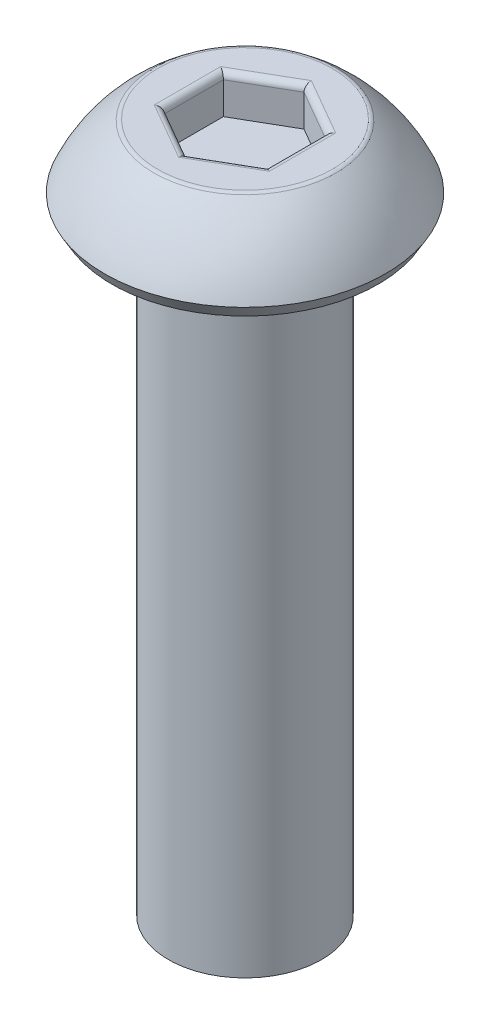
ISO-10303-21;
HEADER;
FILE_DESCRIPTION(('STEP AP214'),'2;1');
FILE_NAME('part.step','',(''),(''),'','','');
FILE_SCHEMA(('AUTOMOTIVE_DESIGN { 1 0 10303 214 1 1 1 1 }'));
ENDSEC;
DATA;
#1=APPLICATION_CONTEXT('core data for automotive mechanical design processes');
#2=APPLICATION_PROTOCOL_DEFINITION('international standard','automotive_design',2000,#1);
#3=PRODUCT_CONTEXT('',#1,'mechanical');
#4=PRODUCT('Part','Part','',(#3));
#5=PRODUCT_RELATED_PRODUCT_CATEGORY('part','',(#4));
#6=PRODUCT_DEFINITION_FORMATION('','',#4);
#7=PRODUCT_DEFINITION_CONTEXT('part definition',#1,'design');
#8=PRODUCT_DEFINITION('design','',#6,#7);
#9=PRODUCT_DEFINITION_SHAPE('','',#8);
#10=(LENGTH_UNIT() NAMED_UNIT(*) SI_UNIT(.MILLI.,.METRE.));
#11=(NAMED_UNIT(*) PLANE_ANGLE_UNIT() SI_UNIT($,.RADIAN.));
#12=(NAMED_UNIT(*) SI_UNIT($,.STERADIAN.) SOLID_ANGLE_UNIT());
#13=UNCERTAINTY_MEASURE_WITH_UNIT(LENGTH_MEASURE(1.E-05),#10,'distance_accuracy_value','');
#14=(GEOMETRIC_REPRESENTATION_CONTEXT(3) GLOBAL_UNCERTAINTY_ASSIGNED_CONTEXT((#13)) GLOBAL_UNIT_ASSIGNED_CONTEXT((#10,
#11,#12)) REPRESENTATION_CONTEXT('',''));
#15=CARTESIAN_POINT('',(0.,0.,0.));
#16=DIRECTION('',(0.,0.,1.));
#17=DIRECTION('',(1.,0.,0.));
#18=AXIS2_PLACEMENT_3D('',#15,#16,#17);
#19=CARTESIAN_POINT('',(0.,1.5,0.));
#20=DIRECTION('',(0.,-1.,0.));
#21=DIRECTION('',(0.,0.,-1.));
#22=AXIS2_PLACEMENT_3D('',#19,#20,#21);
#23=PLANE('',#22);
#24=CARTESIAN_POINT('',(0.,1.5,0.));
#25=DIRECTION('',(0.,-1.,0.));
#26=DIRECTION('',(0.,0.,-1.));
#27=AXIS2_PLACEMENT_3D('',#24,#25,#26);
#28=CIRCLE('',#27,1.70906948191647);
#29=CARTESIAN_POINT('',(0.,1.5,-1.70906948191647));
#30=VERTEX_POINT('',#29);
#31=EDGE_CURVE('E178',#30,#30,#28,.F.);
#32=ORIENTED_EDGE('',*,*,#31,.T.);
#33=EDGE_LOOP('',(#32));
#34=FACE_BOUND('',#33,.T.);
#35=DIRECTION('',(0.866025403784439,0.,-0.5));
#36=VECTOR('',#35,1.);
#37=CARTESIAN_POINT('',(0.5625,1.5,0.974278579257493));
#38=LINE('',#37,#36);
#39=CARTESIAN_POINT('',(1.125,1.5,0.649519052838329));
#40=VERTEX_POINT('',#39);
#41=CARTESIAN_POINT('',(0.,1.5,1.29903810567666));
#42=VERTEX_POINT('',#41);
#43=EDGE_CURVE('E173',#40,#42,#38,.F.);
#44=ORIENTED_EDGE('',*,*,#43,.T.);
#45=DIRECTION('',(0.866025403784439,0.,0.5));
#46=VECTOR('',#45,1.);
#47=CARTESIAN_POINT('',(-0.5625,1.5,0.974278579257493));
#48=LINE('',#47,#46);
#49=CARTESIAN_POINT('',(-1.125,1.5,0.649519052838329));
#50=VERTEX_POINT('',#49);
#51=EDGE_CURVE('E175',#42,#50,#48,.F.);
#52=ORIENTED_EDGE('',*,*,#51,.T.);
#53=DIRECTION('',(0.,0.,1.));
#54=VECTOR('',#53,1.);
#55=CARTESIAN_POINT('',(-1.125,1.5,0.));
#56=LINE('',#55,#54);
#57=CARTESIAN_POINT('',(-1.125,1.5,-0.649519052838329));
#58=VERTEX_POINT('',#57);
#59=EDGE_CURVE('E165',#50,#58,#56,.F.);
#60=ORIENTED_EDGE('',*,*,#59,.T.);
#61=DIRECTION('',(-0.866025403784439,0.,0.5));
#62=VECTOR('',#61,1.);
#63=CARTESIAN_POINT('',(-0.5625,1.5,-0.974278579257493));
#64=LINE('',#63,#62);
#65=CARTESIAN_POINT('',(0.,1.5,-1.29903810567666));
#66=VERTEX_POINT('',#65);
#67=EDGE_CURVE('E167',#58,#66,#64,.F.);
#68=ORIENTED_EDGE('',*,*,#67,.T.);
#69=DIRECTION('',(-0.866025403784439,0.,-0.5));
#70=VECTOR('',#69,1.);
#71=CARTESIAN_POINT('',(0.5625,1.5,-0.974278579257494));
#72=LINE('',#71,#70);
#73=CARTESIAN_POINT('',(1.125,1.5,-0.64951905283833));
#74=VERTEX_POINT('',#73);
#75=EDGE_CURVE('E169',#66,#74,#72,.F.);
#76=ORIENTED_EDGE('',*,*,#75,.T.);
#77=DIRECTION('',(0.,0.,-1.));
#78=VECTOR('',#77,1.);
#79=CARTESIAN_POINT('',(1.125,1.5,0.));
#80=LINE('',#79,#78);
#81=EDGE_CURVE('E171',#74,#40,#80,.F.);
#82=ORIENTED_EDGE('',*,*,#81,.T.);
#83=EDGE_LOOP('',(#44,#52,#60,#68,#76,#82));
#84=FACE_BOUND('',#83,.T.);
#85=ADVANCED_FACE('F36',(#34,#84),#23,.F.);
#86=CARTESIAN_POINT('',(0.,-0.931154789034212,0.));
#87=DIRECTION('',(0.,-1.,0.));
#88=DIRECTION('',(0.,0.,-1.));
#89=AXIS2_PLACEMENT_3D('',#86,#87,#88);
#90=DEGENERATE_TOROIDAL_SURFACE('',#89,0.00769348629276519,3.,.F.);
#91=CARTESIAN_POINT('',(0.,1.47526759952323,0.));
#92=DIRECTION('',(0.,-1.,0.));
#93=DIRECTION('',(0.,0.,-1.));
#94=AXIS2_PLACEMENT_3D('',#91,#92,#93);
#95=CIRCLE('',#94,1.78371135009948);
#96=CARTESIAN_POINT('',(0.,1.47526759952323,-1.78371135009948));
#97=VERTEX_POINT('',#96);
#98=EDGE_CURVE('E162',#97,#97,#95,.T.);
#99=ORIENTED_EDGE('',*,*,#98,.T.);
#100=EDGE_LOOP('',(#99));
#101=FACE_BOUND('',#100,.T.);
#102=CARTESIAN_POINT('',(0.,0.25,0.));
#103=DIRECTION('',(0.,-1.,0.));
#104=DIRECTION('',(0.,0.,-1.));
#105=AXIS2_PLACEMENT_3D('',#102,#103,#104);
#106=CIRCLE('',#105,2.75);
#107=CARTESIAN_POINT('',(0.,0.25,-2.75));
#108=VERTEX_POINT('',#107);
#109=EDGE_CURVE('E159',#108,#108,#106,.T.);
#110=ORIENTED_EDGE('',*,*,#109,.F.);
#111=EDGE_LOOP('',(#110));
#112=FACE_BOUND('',#111,.T.);
#113=ADVANCED_FACE('F245',(#101,#112),#90,.F.);
#114=CARTESIAN_POINT('',(0.,0.25,0.));
#115=DIRECTION('',(0.,1.,0.));
#116=DIRECTION('',(0.,0.,1.));
#117=AXIS2_PLACEMENT_3D('',#114,#115,#116);
#118=CONICAL_SURFACE('',#117,2.75,0.523598775598296);
#119=CARTESIAN_POINT('',(0.,0.,0.));
#120=DIRECTION('',(0.,-1.,0.));
#121=DIRECTION('',(0.,0.,-1.));
#122=AXIS2_PLACEMENT_3D('',#119,#120,#121);
#123=CIRCLE('',#122,2.60566243270259);
#124=CARTESIAN_POINT('',(0.,0.,-2.60566243270259));
#125=VERTEX_POINT('',#124);
#126=EDGE_CURVE('E156',#125,#125,#123,.T.);
#127=ORIENTED_EDGE('',*,*,#126,.F.);
#128=EDGE_LOOP('',(#127));
#129=FACE_BOUND('',#128,.T.);
#130=ORIENTED_EDGE('',*,*,#109,.T.);
#131=EDGE_LOOP('',(#130));
#132=FACE_BOUND('',#131,.T.);
#133=ADVANCED_FACE('F251',(#129,#132),#118,.T.);
#134=CARTESIAN_POINT('',(0.,0.,2.60566243270259));
#135=DIRECTION('',(0.,1.,0.));
#136=DIRECTION('',(0.,0.,1.));
#137=AXIS2_PLACEMENT_3D('',#134,#135,#136);
#138=PLANE('',#137);
#139=CARTESIAN_POINT('',(0.,0.,0.));
#140=DIRECTION('',(0.,-1.,0.));
#141=DIRECTION('',(0.,0.,-1.));
#142=AXIS2_PLACEMENT_3D('',#139,#140,#141);
#143=CIRCLE('',#142,1.5);
#144=CARTESIAN_POINT('',(0.,0.,-1.5));
#145=VERTEX_POINT('',#144);
#146=EDGE_CURVE('E153',#145,#145,#143,.T.);
#147=ORIENTED_EDGE('',*,*,#146,.F.);
#148=EDGE_LOOP('',(#147));
#149=FACE_BOUND('',#148,.T.);
#150=ORIENTED_EDGE('',*,*,#126,.T.);
#151=EDGE_LOOP('',(#150));
#152=FACE_BOUND('',#151,.T.);
#153=ADVANCED_FACE('F270',(#149,#152),#138,.F.);
#154=CARTESIAN_POINT('',(0.,-12.,0.));
#155=DIRECTION('',(0.,-1.,0.));
#156=DIRECTION('',(0.,0.,-1.));
#157=AXIS2_PLACEMENT_3D('',#154,#155,#156);
#158=CYLINDRICAL_SURFACE('',#157,1.5);
#159=CARTESIAN_POINT('',(0.,-12.,0.));
#160=DIRECTION('',(0.,-1.,0.));
#161=DIRECTION('',(0.,0.,-1.));
#162=AXIS2_PLACEMENT_3D('',#159,#160,#161);
#163=CIRCLE('',#162,1.5);
#164=CARTESIAN_POINT('',(0.,-12.,-1.5));
#165=VERTEX_POINT('',#164);
#166=EDGE_CURVE('E140',#165,#165,#163,.T.);
#167=ORIENTED_EDGE('',*,*,#166,.F.);
#168=EDGE_LOOP('',(#167));
#169=FACE_BOUND('',#168,.T.);
#170=ORIENTED_EDGE('',*,*,#146,.T.);
#171=EDGE_LOOP('',(#170));
#172=FACE_BOUND('',#171,.T.);
#173=ADVANCED_FACE('F275',(#169,#172),#158,.T.);
#174=CARTESIAN_POINT('',(0.,-12.,1.5));
#175=DIRECTION('',(0.,1.,0.));
#176=DIRECTION('',(0.,0.,1.));
#177=AXIS2_PLACEMENT_3D('',#174,#175,#176);
#178=PLANE('',#177);
#179=ORIENTED_EDGE('',*,*,#166,.T.);
#180=EDGE_LOOP('',(#179));
#181=FACE_BOUND('',#180,.T.);
#182=ADVANCED_FACE('F282',(#181),#178,.F.);
#183=CARTESIAN_POINT('',(0.999999999999999,0.75,-0.577350269189626));
#184=DIRECTION('',(0.5,0.,-0.866025403784439));
#185=DIRECTION('',(-0.866025403784439,0.,-0.5));
#186=AXIS2_PLACEMENT_3D('',#183,#184,#185);
#187=PLANE('',#186);
#188=DIRECTION('',(0.,1.,0.));
#189=VECTOR('',#188,1.);
#190=CARTESIAN_POINT('',(0.999999999999999,0.75,-0.577350269189626));
#191=LINE('',#190,#189);
#192=CARTESIAN_POINT('',(0.999999999999999,0.75,-0.577350269189626));
#193=VERTEX_POINT('',#192);
#194=CARTESIAN_POINT('',(0.999999999999999,1.375,-0.577350269189626));
#195=VERTEX_POINT('',#194);
#196=EDGE_CURVE('E138',#193,#195,#191,.T.);
#197=ORIENTED_EDGE('',*,*,#196,.T.);
#198=DIRECTION('',(-0.866025403784439,0.,-0.5));
#199=VECTOR('',#198,1.);
#200=CARTESIAN_POINT('',(0.999999999999999,1.375,-0.577350269189626));
#201=LINE('',#200,#199);
#202=CARTESIAN_POINT('',(0.,1.375,-1.15470053837925));
#203=VERTEX_POINT('',#202);
#204=EDGE_CURVE('E60',#195,#203,#201,.T.);
#205=ORIENTED_EDGE('',*,*,#204,.T.);
#206=DIRECTION('',(0.,1.,0.));
#207=VECTOR('',#206,1.);
#208=CARTESIAN_POINT('',(0.,0.75,-1.15470053837925));
#209=LINE('',#208,#207);
#210=CARTESIAN_POINT('',(0.,0.75,-1.15470053837925));
#211=VERTEX_POINT('',#210);
#212=EDGE_CURVE('E106',#211,#203,#209,.T.);
#213=ORIENTED_EDGE('',*,*,#212,.F.);
#214=DIRECTION('',(-0.866025403784439,0.,-0.5));
#215=VECTOR('',#214,1.);
#216=CARTESIAN_POINT('',(0.999999999999999,0.75,-0.577350269189626));
#217=LINE('',#216,#215);
#218=EDGE_CURVE('E110',#193,#211,#217,.T.);
#219=ORIENTED_EDGE('',*,*,#218,.F.);
#220=EDGE_LOOP('',(#197,#205,#213,#219));
#221=FACE_BOUND('',#220,.T.);
#222=ADVANCED_FACE('F108',(#221),#187,.F.);
#223=CARTESIAN_POINT('',(1.,0.75,0.577350269189626));
#224=DIRECTION('',(1.,0.,0.));
#225=DIRECTION('',(0.,0.,-1.));
#226=AXIS2_PLACEMENT_3D('',#223,#224,#225);
#227=PLANE('',#226);
#228=DIRECTION('',(0.,1.,0.));
#229=VECTOR('',#228,1.);
#230=CARTESIAN_POINT('',(1.,0.75,0.577350269189626));
#231=LINE('',#230,#229);
#232=CARTESIAN_POINT('',(1.,0.75,0.577350269189626));
#233=VERTEX_POINT('',#232);
#234=CARTESIAN_POINT('',(1.,1.375,0.577350269189626));
#235=VERTEX_POINT('',#234);
#236=EDGE_CURVE('E141',#233,#235,#231,.T.);
#237=ORIENTED_EDGE('',*,*,#236,.T.);
#238=DIRECTION('',(0.,0.,-1.));
#239=VECTOR('',#238,1.);
#240=CARTESIAN_POINT('',(1.,1.375,0.577350269189626));
#241=LINE('',#240,#239);
#242=EDGE_CURVE('E186',#235,#195,#241,.T.);
#243=ORIENTED_EDGE('',*,*,#242,.T.);
#244=ORIENTED_EDGE('',*,*,#196,.F.);
#245=DIRECTION('',(0.,0.,-1.));
#246=VECTOR('',#245,1.);
#247=CARTESIAN_POINT('',(1.,0.75,0.577350269189626));
#248=LINE('',#247,#246);
#249=EDGE_CURVE('E114',#233,#193,#248,.T.);
#250=ORIENTED_EDGE('',*,*,#249,.F.);
#251=EDGE_LOOP('',(#237,#243,#244,#250));
#252=FACE_BOUND('',#251,.T.);
#253=ADVANCED_FACE('F226',(#252),#227,.F.);
#254=CARTESIAN_POINT('',(0.,0.75,1.15470053837925));
#255=DIRECTION('',(0.5,0.,0.866025403784439));
#256=DIRECTION('',(0.866025403784439,0.,-0.5));
#257=AXIS2_PLACEMENT_3D('',#254,#255,#256);
#258=PLANE('',#257);
#259=DIRECTION('',(0.,1.,0.));
#260=VECTOR('',#259,1.);
#261=CARTESIAN_POINT('',(0.,0.75,1.15470053837925));
#262=LINE('',#261,#260);
#263=CARTESIAN_POINT('',(0.,0.75,1.15470053837925));
#264=VERTEX_POINT('',#263);
#265=CARTESIAN_POINT('',(0.,1.375,1.15470053837925));
#266=VERTEX_POINT('',#265);
#267=EDGE_CURVE('E144',#264,#266,#262,.T.);
#268=ORIENTED_EDGE('',*,*,#267,.T.);
#269=DIRECTION('',(0.866025403784439,0.,-0.5));
#270=VECTOR('',#269,1.);
#271=CARTESIAN_POINT('',(0.,1.375,1.15470053837925));
#272=LINE('',#271,#270);
#273=EDGE_CURVE('E184',#266,#235,#272,.T.);
#274=ORIENTED_EDGE('',*,*,#273,.T.);
#275=ORIENTED_EDGE('',*,*,#236,.F.);
#276=DIRECTION('',(0.866025403784439,0.,-0.5));
#277=VECTOR('',#276,1.);
#278=CARTESIAN_POINT('',(0.,0.75,1.15470053837925));
#279=LINE('',#278,#277);
#280=EDGE_CURVE('E135',#264,#233,#279,.T.);
#281=ORIENTED_EDGE('',*,*,#280,.F.);
#282=EDGE_LOOP('',(#268,#274,#275,#281));
#283=FACE_BOUND('',#282,.T.);
#284=ADVANCED_FACE('F227',(#283),#258,.F.);
#285=CARTESIAN_POINT('',(-0.999999999999999,0.75,0.577350269189626));
#286=DIRECTION('',(-0.5,0.,0.866025403784439));
#287=DIRECTION('',(0.866025403784439,0.,0.5));
#288=AXIS2_PLACEMENT_3D('',#285,#286,#287);
#289=PLANE('',#288);
#290=DIRECTION('',(0.,1.,0.));
#291=VECTOR('',#290,1.);
#292=CARTESIAN_POINT('',(-0.999999999999999,0.75,0.577350269189626));
#293=LINE('',#292,#291);
#294=CARTESIAN_POINT('',(-0.999999999999999,0.75,0.577350269189626));
#295=VERTEX_POINT('',#294);
#296=CARTESIAN_POINT('',(-0.999999999999999,1.375,0.577350269189626));
#297=VERTEX_POINT('',#296);
#298=EDGE_CURVE('E147',#295,#297,#293,.T.);
#299=ORIENTED_EDGE('',*,*,#298,.T.);
#300=DIRECTION('',(0.866025403784439,0.,0.5));
#301=VECTOR('',#300,1.);
#302=CARTESIAN_POINT('',(-0.999999999999999,1.375,0.577350269189626));
#303=LINE('',#302,#301);
#304=EDGE_CURVE('E181',#297,#266,#303,.T.);
#305=ORIENTED_EDGE('',*,*,#304,.T.);
#306=ORIENTED_EDGE('',*,*,#267,.F.);
#307=DIRECTION('',(0.866025403784439,0.,0.5));
#308=VECTOR('',#307,1.);
#309=CARTESIAN_POINT('',(-0.999999999999999,0.75,0.577350269189626));
#310=LINE('',#309,#308);
#311=EDGE_CURVE('E132',#295,#264,#310,.T.);
#312=ORIENTED_EDGE('',*,*,#311,.F.);
#313=EDGE_LOOP('',(#299,#305,#306,#312));
#314=FACE_BOUND('',#313,.T.);
#315=ADVANCED_FACE('F222',(#314),#289,.F.);
#316=CARTESIAN_POINT('',(-1.,0.75,-0.577350269189626));
#317=DIRECTION('',(-1.,0.,0.));
#318=DIRECTION('',(0.,0.,1.));
#319=AXIS2_PLACEMENT_3D('',#316,#317,#318);
#320=PLANE('',#319);
#321=DIRECTION('',(0.,1.,0.));
#322=VECTOR('',#321,1.);
#323=CARTESIAN_POINT('',(-1.,0.75,-0.577350269189626));
#324=LINE('',#323,#322);
#325=CARTESIAN_POINT('',(-1.,0.75,-0.577350269189626));
#326=VERTEX_POINT('',#325);
#327=CARTESIAN_POINT('',(-1.,1.375,-0.577350269189626));
#328=VERTEX_POINT('',#327);
#329=EDGE_CURVE('E113',#326,#328,#324,.T.);
#330=ORIENTED_EDGE('',*,*,#329,.T.);
#331=DIRECTION('',(0.,0.,1.));
#332=VECTOR('',#331,1.);
#333=CARTESIAN_POINT('',(-1.,1.375,-0.577350269189626));
#334=LINE('',#333,#332);
#335=EDGE_CURVE('E11',#328,#297,#334,.T.);
#336=ORIENTED_EDGE('',*,*,#335,.T.);
#337=ORIENTED_EDGE('',*,*,#298,.F.);
#338=DIRECTION('',(0.,0.,1.));
#339=VECTOR('',#338,1.);
#340=CARTESIAN_POINT('',(-1.,0.75,-0.577350269189626));
#341=LINE('',#340,#339);
#342=EDGE_CURVE('E122',#326,#295,#341,.T.);
#343=ORIENTED_EDGE('',*,*,#342,.F.);
#344=EDGE_LOOP('',(#330,#336,#337,#343));
#345=FACE_BOUND('',#344,.T.);
#346=ADVANCED_FACE('F219',(#345),#320,.F.);
#347=CARTESIAN_POINT('',(0.,0.75,-1.15470053837925));
#348=DIRECTION('',(-0.5,0.,-0.866025403784438));
#349=DIRECTION('',(-0.866025403784439,0.,0.5));
#350=AXIS2_PLACEMENT_3D('',#347,#348,#349);
#351=PLANE('',#350);
#352=ORIENTED_EDGE('',*,*,#212,.T.);
#353=DIRECTION('',(-0.866025403784439,0.,0.5));
#354=VECTOR('',#353,1.);
#355=CARTESIAN_POINT('',(0.,1.375,-1.15470053837925));
#356=LINE('',#355,#354);
#357=EDGE_CURVE('E45',#203,#328,#356,.T.);
#358=ORIENTED_EDGE('',*,*,#357,.T.);
#359=ORIENTED_EDGE('',*,*,#329,.F.);
#360=DIRECTION('',(-0.866025403784439,0.,0.5));
#361=VECTOR('',#360,1.);
#362=CARTESIAN_POINT('',(0.,0.75,-1.15470053837925));
#363=LINE('',#362,#361);
#364=EDGE_CURVE('E117',#211,#326,#363,.T.);
#365=ORIENTED_EDGE('',*,*,#364,.F.);
#366=EDGE_LOOP('',(#352,#358,#359,#365));
#367=FACE_BOUND('',#366,.T.);
#368=ADVANCED_FACE('F118',(#367),#351,.F.);
#369=CARTESIAN_POINT('',(0.,0.75,0.));
#370=DIRECTION('',(0.,1.,0.));
#371=DIRECTION('',(0.,0.,1.));
#372=AXIS2_PLACEMENT_3D('',#369,#370,#371);
#373=PLANE('',#372);
#374=ORIENTED_EDGE('',*,*,#218,.T.);
#375=ORIENTED_EDGE('',*,*,#364,.T.);
#376=ORIENTED_EDGE('',*,*,#342,.T.);
#377=ORIENTED_EDGE('',*,*,#311,.T.);
#378=ORIENTED_EDGE('',*,*,#280,.T.);
#379=ORIENTED_EDGE('',*,*,#249,.T.);
#380=EDGE_LOOP('',(#374,#375,#376,#377,#378,#379));
#381=FACE_BOUND('',#380,.T.);
#382=ADVANCED_FACE('F124',(#381),#373,.T.);
#383=CARTESIAN_POINT('',(0.,1.375,0.));
#384=DIRECTION('',(0.,-1.,0.));
#385=DIRECTION('',(0.,0.,-1.));
#386=AXIS2_PLACEMENT_3D('',#383,#384,#385);
#387=TOROIDAL_SURFACE('',#386,1.70906948191647,0.125);
#388=ORIENTED_EDGE('',*,*,#31,.F.);
#389=EDGE_LOOP('',(#388));
#390=FACE_BOUND('',#389,.T.);
#391=ORIENTED_EDGE('',*,*,#98,.F.);
#392=EDGE_LOOP('',(#391));
#393=FACE_BOUND('',#392,.T.);
#394=ADVANCED_FACE('F255',(#390,#393),#387,.T.);
#395=CARTESIAN_POINT('',(1.0625,1.375,-0.685603444662681));
#396=DIRECTION('',(-0.866025403784439,0.,-0.5));
#397=DIRECTION('',(-0.5,0.,0.866025403784439));
#398=AXIS2_PLACEMENT_3D('',#395,#396,#397);
#399=CYLINDRICAL_SURFACE('',#398,0.125);
#400=CARTESIAN_POINT('',(1.125,1.375,-0.64951905283833));
#401=DIRECTION('',(-0.5,0.,-0.866025403784438));
#402=DIRECTION('',(0.866025403784439,0.,-0.5));
#403=AXIS2_PLACEMENT_3D('',#400,#401,#402);
#404=ELLIPSE('',#403,0.144337567297406,0.125);
#405=EDGE_CURVE('E129',#74,#195,#404,.F.);
#406=ORIENTED_EDGE('',*,*,#405,.F.);
#407=ORIENTED_EDGE('',*,*,#75,.F.);
#408=CARTESIAN_POINT('',(0.,1.375,-1.29903810567666));
#409=DIRECTION('',(-1.,0.,0.));
#410=DIRECTION('',(0.,0.,-1.));
#411=AXIS2_PLACEMENT_3D('',#408,#409,#410);
#412=ELLIPSE('',#411,0.144337567297406,0.125);
#413=EDGE_CURVE('E40',#203,#66,#412,.T.);
#414=ORIENTED_EDGE('',*,*,#413,.F.);
#415=ORIENTED_EDGE('',*,*,#204,.F.);
#416=EDGE_LOOP('',(#406,#407,#414,#415));
#417=FACE_BOUND('',#416,.T.);
#418=ADVANCED_FACE('F38',(#417),#399,.T.);
#419=CARTESIAN_POINT('',(-0.0625000000000002,1.375,-1.26295371385231));
#420=DIRECTION('',(-0.866025403784439,0.,0.5));
#421=DIRECTION('',(0.5,0.,0.866025403784439));
#422=AXIS2_PLACEMENT_3D('',#419,#420,#421);
#423=CYLINDRICAL_SURFACE('',#422,0.125);
#424=ORIENTED_EDGE('',*,*,#413,.T.);
#425=ORIENTED_EDGE('',*,*,#67,.F.);
#426=CARTESIAN_POINT('',(-1.125,1.375,-0.649519052838329));
#427=DIRECTION('',(-0.5,0.,0.866025403784439));
#428=DIRECTION('',(-0.866025403784439,0.,-0.5));
#429=AXIS2_PLACEMENT_3D('',#426,#427,#428);
#430=ELLIPSE('',#429,0.144337567297406,0.125);
#431=EDGE_CURVE('E197',#328,#58,#430,.T.);
#432=ORIENTED_EDGE('',*,*,#431,.F.);
#433=ORIENTED_EDGE('',*,*,#357,.F.);
#434=EDGE_LOOP('',(#424,#425,#432,#433));
#435=FACE_BOUND('',#434,.T.);
#436=ADVANCED_FACE('F211',(#435),#423,.T.);
#437=CARTESIAN_POINT('',(1.125,1.375,0.577350269189626));
#438=DIRECTION('',(0.,0.,-1.));
#439=DIRECTION('',(-1.,0.,0.));
#440=AXIS2_PLACEMENT_3D('',#437,#438,#439);
#441=CYLINDRICAL_SURFACE('',#440,0.125);
#442=ORIENTED_EDGE('',*,*,#405,.T.);
#443=ORIENTED_EDGE('',*,*,#242,.F.);
#444=CARTESIAN_POINT('',(1.125,1.375,0.649519052838329));
#445=DIRECTION('',(0.5,0.,-0.866025403784439));
#446=DIRECTION('',(0.866025403784439,0.,0.5));
#447=AXIS2_PLACEMENT_3D('',#444,#445,#446);
#448=ELLIPSE('',#447,0.144337567297406,0.125);
#449=EDGE_CURVE('E194',#40,#235,#448,.F.);
#450=ORIENTED_EDGE('',*,*,#449,.F.);
#451=ORIENTED_EDGE('',*,*,#81,.F.);
#452=EDGE_LOOP('',(#442,#443,#450,#451));
#453=FACE_BOUND('',#452,.T.);
#454=ADVANCED_FACE('F204',(#453),#441,.T.);
#455=CARTESIAN_POINT('',(-1.125,1.375,-0.577350269189626));
#456=DIRECTION('',(0.,0.,1.));
#457=DIRECTION('',(1.,0.,0.));
#458=AXIS2_PLACEMENT_3D('',#455,#456,#457);
#459=CYLINDRICAL_SURFACE('',#458,0.125);
#460=ORIENTED_EDGE('',*,*,#431,.T.);
#461=ORIENTED_EDGE('',*,*,#59,.F.);
#462=CARTESIAN_POINT('',(-1.125,1.375,0.649519052838329));
#463=DIRECTION('',(0.5,0.,0.866025403784438));
#464=DIRECTION('',(0.866025403784439,0.,-0.5));
#465=AXIS2_PLACEMENT_3D('',#462,#463,#464);
#466=ELLIPSE('',#465,0.144337567297406,0.125);
#467=EDGE_CURVE('E192',#297,#50,#466,.T.);
#468=ORIENTED_EDGE('',*,*,#467,.F.);
#469=ORIENTED_EDGE('',*,*,#335,.F.);
#470=EDGE_LOOP('',(#460,#461,#468,#469));
#471=FACE_BOUND('',#470,.T.);
#472=ADVANCED_FACE('F216',(#471),#459,.T.);
#473=CARTESIAN_POINT('',(0.0625000000000004,1.375,1.26295371385231));
#474=DIRECTION('',(0.866025403784439,0.,-0.5));
#475=DIRECTION('',(-0.5,0.,-0.866025403784439));
#476=AXIS2_PLACEMENT_3D('',#473,#474,#475);
#477=CYLINDRICAL_SURFACE('',#476,0.125);
#478=ORIENTED_EDGE('',*,*,#449,.T.);
#479=ORIENTED_EDGE('',*,*,#273,.F.);
#480=CARTESIAN_POINT('',(0.,1.375,1.29903810567666));
#481=DIRECTION('',(1.,0.,0.));
#482=DIRECTION('',(0.,0.,1.));
#483=AXIS2_PLACEMENT_3D('',#480,#481,#482);
#484=ELLIPSE('',#483,0.144337567297406,0.125);
#485=EDGE_CURVE('E190',#42,#266,#484,.F.);
#486=ORIENTED_EDGE('',*,*,#485,.F.);
#487=ORIENTED_EDGE('',*,*,#43,.F.);
#488=EDGE_LOOP('',(#478,#479,#486,#487));
#489=FACE_BOUND('',#488,.T.);
#490=ADVANCED_FACE('F231',(#489),#477,.T.);
#491=CARTESIAN_POINT('',(-1.0625,1.375,0.685603444662681));
#492=DIRECTION('',(0.866025403784439,0.,0.5));
#493=DIRECTION('',(0.5,0.,-0.866025403784439));
#494=AXIS2_PLACEMENT_3D('',#491,#492,#493);
#495=CYLINDRICAL_SURFACE('',#494,0.125);
#496=ORIENTED_EDGE('',*,*,#467,.T.);
#497=ORIENTED_EDGE('',*,*,#51,.F.);
#498=ORIENTED_EDGE('',*,*,#485,.T.);
#499=ORIENTED_EDGE('',*,*,#304,.F.);
#500=EDGE_LOOP('',(#496,#497,#498,#499));
#501=FACE_BOUND('',#500,.T.);
#502=ADVANCED_FACE('F236',(#501),#495,.T.);
#503=CLOSED_SHELL('',(#85,#113,#133,#153,#173,#182,#222,#253,#284,#315,#346,#368,#382,#394,#418,
#436,#454,#472,#490,#502));
#504=MANIFOLD_SOLID_BREP('B2',#503);
#505=ADVANCED_BREP_SHAPE_REPRESENTATION('',(#18,#504),#14);
#506=SHAPE_DEFINITION_REPRESENTATION(#9,#505);
ENDSEC;
END-ISO-10303-21;
